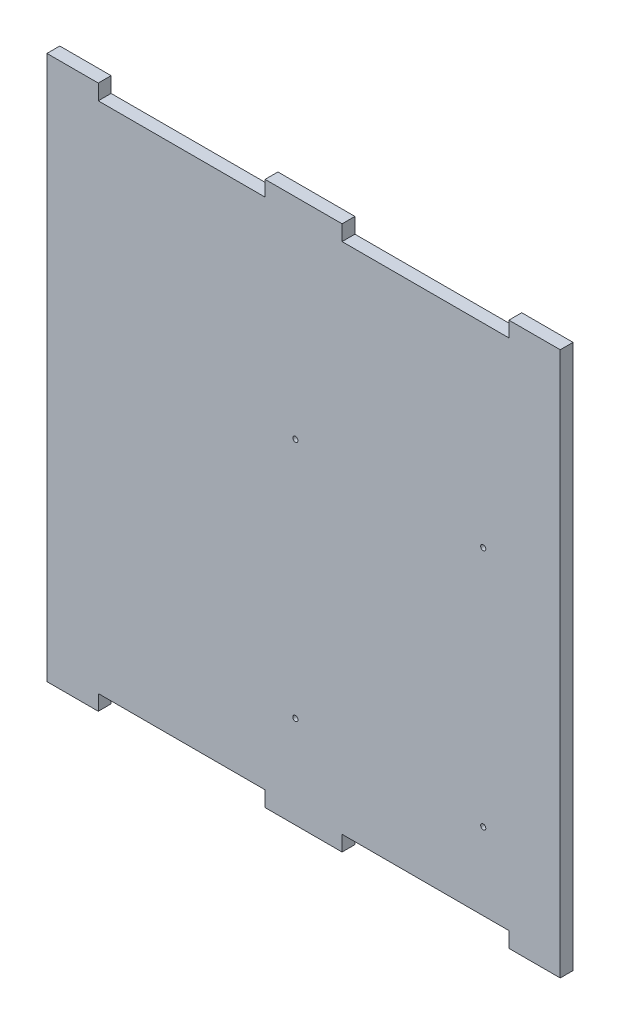
ISO-10303-21;
HEADER;
FILE_DESCRIPTION(('STEP AP214'),'2;1');
FILE_NAME('part.step','',(''),(''),'','','');
FILE_SCHEMA(('AUTOMOTIVE_DESIGN { 1 0 10303 214 1 1 1 1 }'));
ENDSEC;
DATA;
#1=APPLICATION_CONTEXT('core data for automotive mechanical design processes');
#2=APPLICATION_PROTOCOL_DEFINITION('international standard','automotive_design',2000,#1);
#3=PRODUCT_CONTEXT('',#1,'mechanical');
#4=PRODUCT('Part','Part','',(#3));
#5=PRODUCT_RELATED_PRODUCT_CATEGORY('part','',(#4));
#6=PRODUCT_DEFINITION_FORMATION('','',#4);
#7=PRODUCT_DEFINITION_CONTEXT('part definition',#1,'design');
#8=PRODUCT_DEFINITION('design','',#6,#7);
#9=PRODUCT_DEFINITION_SHAPE('','',#8);
#10=(LENGTH_UNIT() NAMED_UNIT(*) SI_UNIT(.MILLI.,.METRE.));
#11=(NAMED_UNIT(*) PLANE_ANGLE_UNIT() SI_UNIT($,.RADIAN.));
#12=(NAMED_UNIT(*) SI_UNIT($,.STERADIAN.) SOLID_ANGLE_UNIT());
#13=UNCERTAINTY_MEASURE_WITH_UNIT(LENGTH_MEASURE(1.E-05),#10,'distance_accuracy_value','');
#14=(GEOMETRIC_REPRESENTATION_CONTEXT(3) GLOBAL_UNCERTAINTY_ASSIGNED_CONTEXT((#13)) GLOBAL_UNIT_ASSIGNED_CONTEXT((#10,
#11,#12)) REPRESENTATION_CONTEXT('',''));
#15=CARTESIAN_POINT('',(0.,0.,0.));
#16=DIRECTION('',(0.,0.,1.));
#17=DIRECTION('',(1.,0.,0.));
#18=AXIS2_PLACEMENT_3D('',#15,#16,#17);
#19=CARTESIAN_POINT('',(0.,0.,5.));
#20=DIRECTION('',(0.,0.,-1.));
#21=DIRECTION('',(-1.,0.,0.));
#22=AXIS2_PLACEMENT_3D('',#19,#20,#21);
#23=PLANE('',#22);
#24=DIRECTION('',(1.,0.,0.));
#25=VECTOR('',#24,1.);
#26=CARTESIAN_POINT('',(20.,0.,5.));
#27=LINE('',#26,#25);
#28=CARTESIAN_POINT('',(0.,0.,5.));
#29=VERTEX_POINT('',#28);
#30=CARTESIAN_POINT('',(20.,0.,5.));
#31=VERTEX_POINT('',#30);
#32=EDGE_CURVE('E241',#29,#31,#27,.T.);
#33=ORIENTED_EDGE('',*,*,#32,.T.);
#34=DIRECTION('',(0.,1.,0.));
#35=VECTOR('',#34,1.);
#36=CARTESIAN_POINT('',(20.,6.,5.));
#37=LINE('',#36,#35);
#38=CARTESIAN_POINT('',(20.,6.,5.));
#39=VERTEX_POINT('',#38);
#40=EDGE_CURVE('E129',#31,#39,#37,.T.);
#41=ORIENTED_EDGE('',*,*,#40,.T.);
#42=DIRECTION('',(1.,0.,0.));
#43=VECTOR('',#42,1.);
#44=CARTESIAN_POINT('',(20.,6.,5.));
#45=LINE('',#44,#43);
#46=CARTESIAN_POINT('',(85.,6.,5.));
#47=VERTEX_POINT('',#46);
#48=EDGE_CURVE('E292',#39,#47,#45,.T.);
#49=ORIENTED_EDGE('',*,*,#48,.T.);
#50=DIRECTION('',(0.,-1.,0.));
#51=VECTOR('',#50,1.);
#52=CARTESIAN_POINT('',(85.,6.,5.));
#53=LINE('',#52,#51);
#54=CARTESIAN_POINT('',(85.,0.,5.));
#55=VERTEX_POINT('',#54);
#56=EDGE_CURVE('E311',#47,#55,#53,.T.);
#57=ORIENTED_EDGE('',*,*,#56,.T.);
#58=DIRECTION('',(1.,0.,0.));
#59=VECTOR('',#58,1.);
#60=CARTESIAN_POINT('',(85.,0.,5.));
#61=LINE('',#60,#59);
#62=CARTESIAN_POINT('',(115.,0.,5.));
#63=VERTEX_POINT('',#62);
#64=EDGE_CURVE('E308',#55,#63,#61,.T.);
#65=ORIENTED_EDGE('',*,*,#64,.T.);
#66=DIRECTION('',(0.,1.,0.));
#67=VECTOR('',#66,1.);
#68=CARTESIAN_POINT('',(115.,0.,5.));
#69=LINE('',#68,#67);
#70=CARTESIAN_POINT('',(115.,6.,5.));
#71=VERTEX_POINT('',#70);
#72=EDGE_CURVE('E310',#63,#71,#69,.T.);
#73=ORIENTED_EDGE('',*,*,#72,.T.);
#74=DIRECTION('',(1.,0.,0.));
#75=VECTOR('',#74,1.);
#76=CARTESIAN_POINT('',(115.,6.,5.));
#77=LINE('',#76,#75);
#78=CARTESIAN_POINT('',(180.,6.,5.));
#79=VERTEX_POINT('',#78);
#80=EDGE_CURVE('E313',#71,#79,#77,.T.);
#81=ORIENTED_EDGE('',*,*,#80,.T.);
#82=DIRECTION('',(0.,-1.,0.));
#83=VECTOR('',#82,1.);
#84=CARTESIAN_POINT('',(180.,0.,5.));
#85=LINE('',#84,#83);
#86=CARTESIAN_POINT('',(180.,0.,5.));
#87=VERTEX_POINT('',#86);
#88=EDGE_CURVE('E319',#79,#87,#85,.T.);
#89=ORIENTED_EDGE('',*,*,#88,.T.);
#90=DIRECTION('',(1.,0.,0.));
#91=VECTOR('',#90,1.);
#92=CARTESIAN_POINT('',(200.,0.,5.));
#93=LINE('',#92,#91);
#94=CARTESIAN_POINT('',(200.,0.,5.));
#95=VERTEX_POINT('',#94);
#96=EDGE_CURVE('E321',#87,#95,#93,.T.);
#97=ORIENTED_EDGE('',*,*,#96,.T.);
#98=DIRECTION('',(0.,1.,0.));
#99=VECTOR('',#98,1.);
#100=CARTESIAN_POINT('',(200.,212.,5.));
#101=LINE('',#100,#99);
#102=CARTESIAN_POINT('',(200.,212.,5.));
#103=VERTEX_POINT('',#102);
#104=EDGE_CURVE('E323',#95,#103,#101,.T.);
#105=ORIENTED_EDGE('',*,*,#104,.T.);
#106=DIRECTION('',(-1.,0.,0.));
#107=VECTOR('',#106,1.);
#108=CARTESIAN_POINT('',(180.,212.,5.));
#109=LINE('',#108,#107);
#110=CARTESIAN_POINT('',(180.,212.,5.));
#111=VERTEX_POINT('',#110);
#112=EDGE_CURVE('E325',#103,#111,#109,.T.);
#113=ORIENTED_EDGE('',*,*,#112,.T.);
#114=DIRECTION('',(0.,-1.,0.));
#115=VECTOR('',#114,1.);
#116=CARTESIAN_POINT('',(180.,206.,5.));
#117=LINE('',#116,#115);
#118=CARTESIAN_POINT('',(180.,206.,5.));
#119=VERTEX_POINT('',#118);
#120=EDGE_CURVE('E327',#111,#119,#117,.T.);
#121=ORIENTED_EDGE('',*,*,#120,.T.);
#122=DIRECTION('',(-1.,0.,0.));
#123=VECTOR('',#122,1.);
#124=CARTESIAN_POINT('',(115.,206.,5.));
#125=LINE('',#124,#123);
#126=CARTESIAN_POINT('',(115.,206.,5.));
#127=VERTEX_POINT('',#126);
#128=EDGE_CURVE('E329',#119,#127,#125,.T.);
#129=ORIENTED_EDGE('',*,*,#128,.T.);
#130=DIRECTION('',(0.,1.,0.));
#131=VECTOR('',#130,1.);
#132=CARTESIAN_POINT('',(115.,212.,5.));
#133=LINE('',#132,#131);
#134=CARTESIAN_POINT('',(115.,212.,5.));
#135=VERTEX_POINT('',#134);
#136=EDGE_CURVE('E331',#127,#135,#133,.T.);
#137=ORIENTED_EDGE('',*,*,#136,.T.);
#138=DIRECTION('',(-1.,0.,0.));
#139=VECTOR('',#138,1.);
#140=CARTESIAN_POINT('',(85.,212.,5.));
#141=LINE('',#140,#139);
#142=CARTESIAN_POINT('',(85.,212.,5.));
#143=VERTEX_POINT('',#142);
#144=EDGE_CURVE('E333',#135,#143,#141,.T.);
#145=ORIENTED_EDGE('',*,*,#144,.T.);
#146=DIRECTION('',(0.,-1.,0.));
#147=VECTOR('',#146,1.);
#148=CARTESIAN_POINT('',(85.,206.,5.));
#149=LINE('',#148,#147);
#150=CARTESIAN_POINT('',(85.,206.,5.));
#151=VERTEX_POINT('',#150);
#152=EDGE_CURVE('E335',#143,#151,#149,.T.);
#153=ORIENTED_EDGE('',*,*,#152,.T.);
#154=DIRECTION('',(-1.,0.,0.));
#155=VECTOR('',#154,1.);
#156=CARTESIAN_POINT('',(20.,206.,5.));
#157=LINE('',#156,#155);
#158=CARTESIAN_POINT('',(20.,206.,5.));
#159=VERTEX_POINT('',#158);
#160=EDGE_CURVE('E184',#151,#159,#157,.T.);
#161=ORIENTED_EDGE('',*,*,#160,.T.);
#162=DIRECTION('',(0.,1.,0.));
#163=VECTOR('',#162,1.);
#164=CARTESIAN_POINT('',(20.,212.,5.));
#165=LINE('',#164,#163);
#166=CARTESIAN_POINT('',(20.,212.,5.));
#167=VERTEX_POINT('',#166);
#168=EDGE_CURVE('E178',#159,#167,#165,.T.);
#169=ORIENTED_EDGE('',*,*,#168,.T.);
#170=DIRECTION('',(-1.,0.,0.));
#171=VECTOR('',#170,1.);
#172=CARTESIAN_POINT('',(0.,212.,5.));
#173=LINE('',#172,#171);
#174=CARTESIAN_POINT('',(0.,212.,5.));
#175=VERTEX_POINT('',#174);
#176=EDGE_CURVE('E182',#167,#175,#173,.T.);
#177=ORIENTED_EDGE('',*,*,#176,.T.);
#178=DIRECTION('',(0.,-1.,0.));
#179=VECTOR('',#178,1.);
#180=CARTESIAN_POINT('',(0.,0.,5.));
#181=LINE('',#180,#179);
#182=EDGE_CURVE('E50',#175,#29,#181,.T.);
#183=ORIENTED_EDGE('',*,*,#182,.T.);
#184=EDGE_LOOP('',(#33,#41,#49,#57,#65,#73,#81,#89,#97,#105,#113,#121,#129,#137,#145,#153,#161,
#169,#177,#183));
#185=FACE_BOUND('',#184,.T.);
#186=CARTESIAN_POINT('',(170.,36.,5.));
#187=DIRECTION('',(0.,0.,1.));
#188=DIRECTION('',(1.,0.,0.));
#189=AXIS2_PLACEMENT_3D('',#186,#187,#188);
#190=CIRCLE('',#189,0.999999999999998);
#191=CARTESIAN_POINT('',(171.,36.,5.));
#192=VERTEX_POINT('',#191);
#193=EDGE_CURVE('E206',#192,#192,#190,.T.);
#194=ORIENTED_EDGE('',*,*,#193,.F.);
#195=EDGE_LOOP('',(#194));
#196=FACE_BOUND('',#195,.T.);
#197=CARTESIAN_POINT('',(96.8,35.9999999999993,5.));
#198=DIRECTION('',(0.,0.,1.));
#199=DIRECTION('',(1.,0.,0.));
#200=AXIS2_PLACEMENT_3D('',#197,#198,#199);
#201=CIRCLE('',#200,0.999999999999998);
#202=CARTESIAN_POINT('',(97.8,35.9999999999993,5.));
#203=VERTEX_POINT('',#202);
#204=EDGE_CURVE('E399',#203,#203,#201,.T.);
#205=ORIENTED_EDGE('',*,*,#204,.F.);
#206=EDGE_LOOP('',(#205));
#207=FACE_BOUND('',#206,.T.);
#208=CARTESIAN_POINT('',(96.7999999999997,130.199999999999,5.));
#209=DIRECTION('',(0.,0.,1.));
#210=DIRECTION('',(1.,0.,0.));
#211=AXIS2_PLACEMENT_3D('',#208,#209,#210);
#212=CIRCLE('',#211,0.999999999999998);
#213=CARTESIAN_POINT('',(97.7999999999997,130.199999999999,5.));
#214=VERTEX_POINT('',#213);
#215=EDGE_CURVE('E393',#214,#214,#212,.T.);
#216=ORIENTED_EDGE('',*,*,#215,.F.);
#217=EDGE_LOOP('',(#216));
#218=FACE_BOUND('',#217,.T.);
#219=CARTESIAN_POINT('',(170.,130.2,5.));
#220=DIRECTION('',(0.,0.,1.));
#221=DIRECTION('',(1.,0.,0.));
#222=AXIS2_PLACEMENT_3D('',#219,#220,#221);
#223=CIRCLE('',#222,0.999999999999998);
#224=CARTESIAN_POINT('',(171.,130.2,5.));
#225=VERTEX_POINT('',#224);
#226=EDGE_CURVE('E384',#225,#225,#223,.T.);
#227=ORIENTED_EDGE('',*,*,#226,.F.);
#228=EDGE_LOOP('',(#227));
#229=FACE_BOUND('',#228,.T.);
#230=ADVANCED_FACE('F33',(#185,#196,#207,#218,#229),#23,.F.);
#231=CARTESIAN_POINT('',(0.,0.,0.));
#232=DIRECTION('',(0.,0.,-1.));
#233=DIRECTION('',(-1.,0.,0.));
#234=AXIS2_PLACEMENT_3D('',#231,#232,#233);
#235=PLANE('',#234);
#236=CARTESIAN_POINT('',(96.7999999999997,130.199999999999,0.));
#237=DIRECTION('',(0.,0.,1.));
#238=DIRECTION('',(1.,0.,0.));
#239=AXIS2_PLACEMENT_3D('',#236,#237,#238);
#240=CIRCLE('',#239,0.999999999999998);
#241=CARTESIAN_POINT('',(97.7999999999997,130.199999999999,0.));
#242=VERTEX_POINT('',#241);
#243=EDGE_CURVE('E390',#242,#242,#240,.T.);
#244=ORIENTED_EDGE('',*,*,#243,.T.);
#245=EDGE_LOOP('',(#244));
#246=FACE_BOUND('',#245,.T.);
#247=CARTESIAN_POINT('',(170.,36.,0.));
#248=DIRECTION('',(0.,0.,1.));
#249=DIRECTION('',(1.,0.,0.));
#250=AXIS2_PLACEMENT_3D('',#247,#248,#249);
#251=CIRCLE('',#250,0.999999999999998);
#252=CARTESIAN_POINT('',(171.,36.,0.));
#253=VERTEX_POINT('',#252);
#254=EDGE_CURVE('E402',#253,#253,#251,.T.);
#255=ORIENTED_EDGE('',*,*,#254,.T.);
#256=EDGE_LOOP('',(#255));
#257=FACE_BOUND('',#256,.T.);
#258=DIRECTION('',(1.,0.,0.));
#259=VECTOR('',#258,1.);
#260=CARTESIAN_POINT('',(20.,0.,0.));
#261=LINE('',#260,#259);
#262=CARTESIAN_POINT('',(0.,0.,0.));
#263=VERTEX_POINT('',#262);
#264=CARTESIAN_POINT('',(20.,0.,0.));
#265=VERTEX_POINT('',#264);
#266=EDGE_CURVE('E202',#263,#265,#261,.T.);
#267=ORIENTED_EDGE('',*,*,#266,.F.);
#268=DIRECTION('',(0.,-1.,0.));
#269=VECTOR('',#268,1.);
#270=CARTESIAN_POINT('',(0.,0.,0.));
#271=LINE('',#270,#269);
#272=CARTESIAN_POINT('',(0.,212.,0.));
#273=VERTEX_POINT('',#272);
#274=EDGE_CURVE('E121',#273,#263,#271,.T.);
#275=ORIENTED_EDGE('',*,*,#274,.F.);
#276=DIRECTION('',(-1.,0.,0.));
#277=VECTOR('',#276,1.);
#278=CARTESIAN_POINT('',(0.,212.,0.));
#279=LINE('',#278,#277);
#280=CARTESIAN_POINT('',(20.,212.,0.));
#281=VERTEX_POINT('',#280);
#282=EDGE_CURVE('E115',#281,#273,#279,.T.);
#283=ORIENTED_EDGE('',*,*,#282,.F.);
#284=DIRECTION('',(0.,1.,0.));
#285=VECTOR('',#284,1.);
#286=CARTESIAN_POINT('',(20.,212.,0.));
#287=LINE('',#286,#285);
#288=CARTESIAN_POINT('',(20.,206.,0.));
#289=VERTEX_POINT('',#288);
#290=EDGE_CURVE('E192',#289,#281,#287,.T.);
#291=ORIENTED_EDGE('',*,*,#290,.F.);
#292=DIRECTION('',(-1.,0.,0.));
#293=VECTOR('',#292,1.);
#294=CARTESIAN_POINT('',(20.,206.,0.));
#295=LINE('',#294,#293);
#296=CARTESIAN_POINT('',(85.,206.,0.));
#297=VERTEX_POINT('',#296);
#298=EDGE_CURVE('E236',#297,#289,#295,.T.);
#299=ORIENTED_EDGE('',*,*,#298,.F.);
#300=DIRECTION('',(0.,-1.,0.));
#301=VECTOR('',#300,1.);
#302=CARTESIAN_POINT('',(85.,206.,0.));
#303=LINE('',#302,#301);
#304=CARTESIAN_POINT('',(85.,212.,0.));
#305=VERTEX_POINT('',#304);
#306=EDGE_CURVE('E234',#305,#297,#303,.T.);
#307=ORIENTED_EDGE('',*,*,#306,.F.);
#308=DIRECTION('',(-1.,0.,0.));
#309=VECTOR('',#308,1.);
#310=CARTESIAN_POINT('',(85.,212.,0.));
#311=LINE('',#310,#309);
#312=CARTESIAN_POINT('',(115.,212.,0.));
#313=VERTEX_POINT('',#312);
#314=EDGE_CURVE('E232',#313,#305,#311,.T.);
#315=ORIENTED_EDGE('',*,*,#314,.F.);
#316=DIRECTION('',(0.,1.,0.));
#317=VECTOR('',#316,1.);
#318=CARTESIAN_POINT('',(115.,212.,0.));
#319=LINE('',#318,#317);
#320=CARTESIAN_POINT('',(115.,206.,0.));
#321=VERTEX_POINT('',#320);
#322=EDGE_CURVE('E230',#321,#313,#319,.T.);
#323=ORIENTED_EDGE('',*,*,#322,.F.);
#324=DIRECTION('',(-1.,0.,0.));
#325=VECTOR('',#324,1.);
#326=CARTESIAN_POINT('',(115.,206.,0.));
#327=LINE('',#326,#325);
#328=CARTESIAN_POINT('',(180.,206.,0.));
#329=VERTEX_POINT('',#328);
#330=EDGE_CURVE('E228',#329,#321,#327,.T.);
#331=ORIENTED_EDGE('',*,*,#330,.F.);
#332=DIRECTION('',(0.,-1.,0.));
#333=VECTOR('',#332,1.);
#334=CARTESIAN_POINT('',(180.,206.,0.));
#335=LINE('',#334,#333);
#336=CARTESIAN_POINT('',(180.,212.,0.));
#337=VERTEX_POINT('',#336);
#338=EDGE_CURVE('E226',#337,#329,#335,.T.);
#339=ORIENTED_EDGE('',*,*,#338,.F.);
#340=DIRECTION('',(-1.,0.,0.));
#341=VECTOR('',#340,1.);
#342=CARTESIAN_POINT('',(180.,212.,0.));
#343=LINE('',#342,#341);
#344=CARTESIAN_POINT('',(200.,212.,0.));
#345=VERTEX_POINT('',#344);
#346=EDGE_CURVE('E224',#345,#337,#343,.T.);
#347=ORIENTED_EDGE('',*,*,#346,.F.);
#348=DIRECTION('',(0.,1.,0.));
#349=VECTOR('',#348,1.);
#350=CARTESIAN_POINT('',(200.,212.,0.));
#351=LINE('',#350,#349);
#352=CARTESIAN_POINT('',(200.,0.,0.));
#353=VERTEX_POINT('',#352);
#354=EDGE_CURVE('E222',#353,#345,#351,.T.);
#355=ORIENTED_EDGE('',*,*,#354,.F.);
#356=DIRECTION('',(1.,0.,0.));
#357=VECTOR('',#356,1.);
#358=CARTESIAN_POINT('',(200.,0.,0.));
#359=LINE('',#358,#357);
#360=CARTESIAN_POINT('',(180.,0.,0.));
#361=VERTEX_POINT('',#360);
#362=EDGE_CURVE('E220',#361,#353,#359,.T.);
#363=ORIENTED_EDGE('',*,*,#362,.F.);
#364=DIRECTION('',(0.,-1.,0.));
#365=VECTOR('',#364,1.);
#366=CARTESIAN_POINT('',(180.,0.,0.));
#367=LINE('',#366,#365);
#368=CARTESIAN_POINT('',(180.,6.,0.));
#369=VERTEX_POINT('',#368);
#370=EDGE_CURVE('E218',#369,#361,#367,.T.);
#371=ORIENTED_EDGE('',*,*,#370,.F.);
#372=DIRECTION('',(1.,0.,0.));
#373=VECTOR('',#372,1.);
#374=CARTESIAN_POINT('',(115.,6.,0.));
#375=LINE('',#374,#373);
#376=CARTESIAN_POINT('',(115.,6.,0.));
#377=VERTEX_POINT('',#376);
#378=EDGE_CURVE('E216',#377,#369,#375,.T.);
#379=ORIENTED_EDGE('',*,*,#378,.F.);
#380=DIRECTION('',(0.,1.,0.));
#381=VECTOR('',#380,1.);
#382=CARTESIAN_POINT('',(115.,0.,0.));
#383=LINE('',#382,#381);
#384=CARTESIAN_POINT('',(115.,0.,0.));
#385=VERTEX_POINT('',#384);
#386=EDGE_CURVE('E214',#385,#377,#383,.T.);
#387=ORIENTED_EDGE('',*,*,#386,.F.);
#388=DIRECTION('',(1.,0.,0.));
#389=VECTOR('',#388,1.);
#390=CARTESIAN_POINT('',(85.,0.,0.));
#391=LINE('',#390,#389);
#392=CARTESIAN_POINT('',(85.,0.,0.));
#393=VERTEX_POINT('',#392);
#394=EDGE_CURVE('E212',#393,#385,#391,.T.);
#395=ORIENTED_EDGE('',*,*,#394,.F.);
#396=DIRECTION('',(0.,-1.,0.));
#397=VECTOR('',#396,1.);
#398=CARTESIAN_POINT('',(85.,6.,0.));
#399=LINE('',#398,#397);
#400=CARTESIAN_POINT('',(85.,6.,0.));
#401=VERTEX_POINT('',#400);
#402=EDGE_CURVE('E210',#401,#393,#399,.T.);
#403=ORIENTED_EDGE('',*,*,#402,.F.);
#404=DIRECTION('',(1.,0.,0.));
#405=VECTOR('',#404,1.);
#406=CARTESIAN_POINT('',(20.,6.,0.));
#407=LINE('',#406,#405);
#408=CARTESIAN_POINT('',(20.,6.,0.));
#409=VERTEX_POINT('',#408);
#410=EDGE_CURVE('E208',#409,#401,#407,.T.);
#411=ORIENTED_EDGE('',*,*,#410,.F.);
#412=DIRECTION('',(0.,1.,0.));
#413=VECTOR('',#412,1.);
#414=CARTESIAN_POINT('',(20.,6.,0.));
#415=LINE('',#414,#413);
#416=EDGE_CURVE('E205',#265,#409,#415,.T.);
#417=ORIENTED_EDGE('',*,*,#416,.F.);
#418=EDGE_LOOP('',(#267,#275,#283,#291,#299,#307,#315,#323,#331,#339,#347,#355,#363,#371,#379,
#387,#395,#403,#411,#417));
#419=FACE_BOUND('',#418,.T.);
#420=CARTESIAN_POINT('',(96.8,35.9999999999993,0.));
#421=DIRECTION('',(0.,0.,1.));
#422=DIRECTION('',(1.,0.,0.));
#423=AXIS2_PLACEMENT_3D('',#420,#421,#422);
#424=CIRCLE('',#423,0.999999999999998);
#425=CARTESIAN_POINT('',(97.8,35.9999999999993,0.));
#426=VERTEX_POINT('',#425);
#427=EDGE_CURVE('E396',#426,#426,#424,.T.);
#428=ORIENTED_EDGE('',*,*,#427,.T.);
#429=EDGE_LOOP('',(#428));
#430=FACE_BOUND('',#429,.T.);
#431=CARTESIAN_POINT('',(170.,130.2,0.));
#432=DIRECTION('',(0.,0.,1.));
#433=DIRECTION('',(1.,0.,0.));
#434=AXIS2_PLACEMENT_3D('',#431,#432,#433);
#435=CIRCLE('',#434,0.999999999999998);
#436=CARTESIAN_POINT('',(171.,130.2,0.));
#437=VERTEX_POINT('',#436);
#438=EDGE_CURVE('E387',#437,#437,#435,.T.);
#439=ORIENTED_EDGE('',*,*,#438,.T.);
#440=EDGE_LOOP('',(#439));
#441=FACE_BOUND('',#440,.T.);
#442=ADVANCED_FACE('F296',(#246,#257,#419,#430,#441),#235,.T.);
#443=CARTESIAN_POINT('',(20.,0.,5.));
#444=DIRECTION('',(0.,1.,0.));
#445=DIRECTION('',(-1.,0.,0.));
#446=AXIS2_PLACEMENT_3D('',#443,#444,#445);
#447=PLANE('',#446);
#448=ORIENTED_EDGE('',*,*,#266,.T.);
#449=DIRECTION('',(0.,0.,-1.));
#450=VECTOR('',#449,1.);
#451=CARTESIAN_POINT('',(20.,0.,5.));
#452=LINE('',#451,#450);
#453=EDGE_CURVE('E11',#31,#265,#452,.T.);
#454=ORIENTED_EDGE('',*,*,#453,.F.);
#455=ORIENTED_EDGE('',*,*,#32,.F.);
#456=DIRECTION('',(0.,0.,-1.));
#457=VECTOR('',#456,1.);
#458=CARTESIAN_POINT('',(0.,0.,5.));
#459=LINE('',#458,#457);
#460=EDGE_CURVE('E198',#29,#263,#459,.T.);
#461=ORIENTED_EDGE('',*,*,#460,.T.);
#462=EDGE_LOOP('',(#448,#454,#455,#461));
#463=FACE_BOUND('',#462,.T.);
#464=ADVANCED_FACE('F35',(#463),#447,.F.);
#465=CARTESIAN_POINT('',(20.,6.,5.));
#466=DIRECTION('',(-1.,0.,0.));
#467=DIRECTION('',(0.,0.,1.));
#468=AXIS2_PLACEMENT_3D('',#465,#466,#467);
#469=PLANE('',#468);
#470=ORIENTED_EDGE('',*,*,#416,.T.);
#471=DIRECTION('',(0.,0.,-1.));
#472=VECTOR('',#471,1.);
#473=CARTESIAN_POINT('',(20.,6.,5.));
#474=LINE('',#473,#472);
#475=EDGE_CURVE('E42',#39,#409,#474,.T.);
#476=ORIENTED_EDGE('',*,*,#475,.F.);
#477=ORIENTED_EDGE('',*,*,#40,.F.);
#478=ORIENTED_EDGE('',*,*,#453,.T.);
#479=EDGE_LOOP('',(#470,#476,#477,#478));
#480=FACE_BOUND('',#479,.T.);
#481=ADVANCED_FACE('F594',(#480),#469,.F.);
#482=CARTESIAN_POINT('',(20.,6.,5.));
#483=DIRECTION('',(0.,1.,0.));
#484=DIRECTION('',(0.,0.,1.));
#485=AXIS2_PLACEMENT_3D('',#482,#483,#484);
#486=PLANE('',#485);
#487=ORIENTED_EDGE('',*,*,#410,.T.);
#488=DIRECTION('',(0.,0.,-1.));
#489=VECTOR('',#488,1.);
#490=CARTESIAN_POINT('',(85.,6.,5.));
#491=LINE('',#490,#489);
#492=EDGE_CURVE('E284',#47,#401,#491,.T.);
#493=ORIENTED_EDGE('',*,*,#492,.F.);
#494=ORIENTED_EDGE('',*,*,#48,.F.);
#495=ORIENTED_EDGE('',*,*,#475,.T.);
#496=EDGE_LOOP('',(#487,#493,#494,#495));
#497=FACE_BOUND('',#496,.T.);
#498=ADVANCED_FACE('F290',(#497),#486,.F.);
#499=CARTESIAN_POINT('',(85.,6.,5.));
#500=DIRECTION('',(1.,0.,0.));
#501=DIRECTION('',(0.,0.,-1.));
#502=AXIS2_PLACEMENT_3D('',#499,#500,#501);
#503=PLANE('',#502);
#504=ORIENTED_EDGE('',*,*,#402,.T.);
#505=DIRECTION('',(0.,0.,-1.));
#506=VECTOR('',#505,1.);
#507=CARTESIAN_POINT('',(85.,0.,5.));
#508=LINE('',#507,#506);
#509=EDGE_CURVE('E281',#55,#393,#508,.T.);
#510=ORIENTED_EDGE('',*,*,#509,.F.);
#511=ORIENTED_EDGE('',*,*,#56,.F.);
#512=ORIENTED_EDGE('',*,*,#492,.T.);
#513=EDGE_LOOP('',(#504,#510,#511,#512));
#514=FACE_BOUND('',#513,.T.);
#515=ADVANCED_FACE('F302',(#514),#503,.F.);
#516=CARTESIAN_POINT('',(85.,0.,5.));
#517=DIRECTION('',(0.,1.,0.));
#518=DIRECTION('',(0.,0.,1.));
#519=AXIS2_PLACEMENT_3D('',#516,#517,#518);
#520=PLANE('',#519);
#521=ORIENTED_EDGE('',*,*,#394,.T.);
#522=DIRECTION('',(0.,0.,-1.));
#523=VECTOR('',#522,1.);
#524=CARTESIAN_POINT('',(115.,0.,5.));
#525=LINE('',#524,#523);
#526=EDGE_CURVE('E278',#63,#385,#525,.T.);
#527=ORIENTED_EDGE('',*,*,#526,.F.);
#528=ORIENTED_EDGE('',*,*,#64,.F.);
#529=ORIENTED_EDGE('',*,*,#509,.T.);
#530=EDGE_LOOP('',(#521,#527,#528,#529));
#531=FACE_BOUND('',#530,.T.);
#532=ADVANCED_FACE('F306',(#531),#520,.F.);
#533=CARTESIAN_POINT('',(115.,0.,5.));
#534=DIRECTION('',(-1.,0.,0.));
#535=DIRECTION('',(0.,0.,1.));
#536=AXIS2_PLACEMENT_3D('',#533,#534,#535);
#537=PLANE('',#536);
#538=ORIENTED_EDGE('',*,*,#386,.T.);
#539=DIRECTION('',(0.,0.,-1.));
#540=VECTOR('',#539,1.);
#541=CARTESIAN_POINT('',(115.,6.,5.));
#542=LINE('',#541,#540);
#543=EDGE_CURVE('E275',#71,#377,#542,.T.);
#544=ORIENTED_EDGE('',*,*,#543,.F.);
#545=ORIENTED_EDGE('',*,*,#72,.F.);
#546=ORIENTED_EDGE('',*,*,#526,.T.);
#547=EDGE_LOOP('',(#538,#544,#545,#546));
#548=FACE_BOUND('',#547,.T.);
#549=ADVANCED_FACE('F559',(#548),#537,.F.);
#550=CARTESIAN_POINT('',(115.,6.,5.));
#551=DIRECTION('',(0.,1.,0.));
#552=DIRECTION('',(0.,0.,1.));
#553=AXIS2_PLACEMENT_3D('',#550,#551,#552);
#554=PLANE('',#553);
#555=ORIENTED_EDGE('',*,*,#378,.T.);
#556=DIRECTION('',(0.,0.,-1.));
#557=VECTOR('',#556,1.);
#558=CARTESIAN_POINT('',(180.,6.,5.));
#559=LINE('',#558,#557);
#560=EDGE_CURVE('E272',#79,#369,#559,.T.);
#561=ORIENTED_EDGE('',*,*,#560,.F.);
#562=ORIENTED_EDGE('',*,*,#80,.F.);
#563=ORIENTED_EDGE('',*,*,#543,.T.);
#564=EDGE_LOOP('',(#555,#561,#562,#563));
#565=FACE_BOUND('',#564,.T.);
#566=ADVANCED_FACE('F549',(#565),#554,.F.);
#567=CARTESIAN_POINT('',(180.,0.,5.));
#568=DIRECTION('',(1.,0.,0.));
#569=DIRECTION('',(0.,0.,-1.));
#570=AXIS2_PLACEMENT_3D('',#567,#568,#569);
#571=PLANE('',#570);
#572=ORIENTED_EDGE('',*,*,#370,.T.);
#573=DIRECTION('',(0.,0.,-1.));
#574=VECTOR('',#573,1.);
#575=CARTESIAN_POINT('',(180.,0.,5.));
#576=LINE('',#575,#574);
#577=EDGE_CURVE('E269',#87,#361,#576,.T.);
#578=ORIENTED_EDGE('',*,*,#577,.F.);
#579=ORIENTED_EDGE('',*,*,#88,.F.);
#580=ORIENTED_EDGE('',*,*,#560,.T.);
#581=EDGE_LOOP('',(#572,#578,#579,#580));
#582=FACE_BOUND('',#581,.T.);
#583=ADVANCED_FACE('F539',(#582),#571,.F.);
#584=CARTESIAN_POINT('',(200.,0.,5.));
#585=DIRECTION('',(0.,1.,0.));
#586=DIRECTION('',(-1.,0.,0.));
#587=AXIS2_PLACEMENT_3D('',#584,#585,#586);
#588=PLANE('',#587);
#589=ORIENTED_EDGE('',*,*,#362,.T.);
#590=DIRECTION('',(0.,0.,-1.));
#591=VECTOR('',#590,1.);
#592=CARTESIAN_POINT('',(200.,0.,5.));
#593=LINE('',#592,#591);
#594=EDGE_CURVE('E266',#95,#353,#593,.T.);
#595=ORIENTED_EDGE('',*,*,#594,.F.);
#596=ORIENTED_EDGE('',*,*,#96,.F.);
#597=ORIENTED_EDGE('',*,*,#577,.T.);
#598=EDGE_LOOP('',(#589,#595,#596,#597));
#599=FACE_BOUND('',#598,.T.);
#600=ADVANCED_FACE('F529',(#599),#588,.F.);
#601=CARTESIAN_POINT('',(200.,212.,5.));
#602=DIRECTION('',(-1.,0.,0.));
#603=DIRECTION('',(0.,-1.,0.));
#604=AXIS2_PLACEMENT_3D('',#601,#602,#603);
#605=PLANE('',#604);
#606=ORIENTED_EDGE('',*,*,#354,.T.);
#607=DIRECTION('',(0.,0.,-1.));
#608=VECTOR('',#607,1.);
#609=CARTESIAN_POINT('',(200.,212.,5.));
#610=LINE('',#609,#608);
#611=EDGE_CURVE('E263',#103,#345,#610,.T.);
#612=ORIENTED_EDGE('',*,*,#611,.F.);
#613=ORIENTED_EDGE('',*,*,#104,.F.);
#614=ORIENTED_EDGE('',*,*,#594,.T.);
#615=EDGE_LOOP('',(#606,#612,#613,#614));
#616=FACE_BOUND('',#615,.T.);
#617=ADVANCED_FACE('F519',(#616),#605,.F.);
#618=CARTESIAN_POINT('',(180.,212.,5.));
#619=DIRECTION('',(0.,-1.,0.));
#620=DIRECTION('',(0.,0.,-1.));
#621=AXIS2_PLACEMENT_3D('',#618,#619,#620);
#622=PLANE('',#621);
#623=ORIENTED_EDGE('',*,*,#346,.T.);
#624=DIRECTION('',(0.,0.,-1.));
#625=VECTOR('',#624,1.);
#626=CARTESIAN_POINT('',(180.,212.,5.));
#627=LINE('',#626,#625);
#628=EDGE_CURVE('E260',#111,#337,#627,.T.);
#629=ORIENTED_EDGE('',*,*,#628,.F.);
#630=ORIENTED_EDGE('',*,*,#112,.F.);
#631=ORIENTED_EDGE('',*,*,#611,.T.);
#632=EDGE_LOOP('',(#623,#629,#630,#631));
#633=FACE_BOUND('',#632,.T.);
#634=ADVANCED_FACE('F509',(#633),#622,.F.);
#635=CARTESIAN_POINT('',(180.,206.,5.));
#636=DIRECTION('',(1.,0.,0.));
#637=DIRECTION('',(0.,0.,-1.));
#638=AXIS2_PLACEMENT_3D('',#635,#636,#637);
#639=PLANE('',#638);
#640=ORIENTED_EDGE('',*,*,#338,.T.);
#641=DIRECTION('',(0.,0.,-1.));
#642=VECTOR('',#641,1.);
#643=CARTESIAN_POINT('',(180.,206.,5.));
#644=LINE('',#643,#642);
#645=EDGE_CURVE('E257',#119,#329,#644,.T.);
#646=ORIENTED_EDGE('',*,*,#645,.F.);
#647=ORIENTED_EDGE('',*,*,#120,.F.);
#648=ORIENTED_EDGE('',*,*,#628,.T.);
#649=EDGE_LOOP('',(#640,#646,#647,#648));
#650=FACE_BOUND('',#649,.T.);
#651=ADVANCED_FACE('F499',(#650),#639,.F.);
#652=CARTESIAN_POINT('',(115.,206.,5.));
#653=DIRECTION('',(0.,-1.,0.));
#654=DIRECTION('',(0.,0.,-1.));
#655=AXIS2_PLACEMENT_3D('',#652,#653,#654);
#656=PLANE('',#655);
#657=ORIENTED_EDGE('',*,*,#330,.T.);
#658=DIRECTION('',(0.,0.,-1.));
#659=VECTOR('',#658,1.);
#660=CARTESIAN_POINT('',(115.,206.,5.));
#661=LINE('',#660,#659);
#662=EDGE_CURVE('E254',#127,#321,#661,.T.);
#663=ORIENTED_EDGE('',*,*,#662,.F.);
#664=ORIENTED_EDGE('',*,*,#128,.F.);
#665=ORIENTED_EDGE('',*,*,#645,.T.);
#666=EDGE_LOOP('',(#657,#663,#664,#665));
#667=FACE_BOUND('',#666,.T.);
#668=ADVANCED_FACE('F489',(#667),#656,.F.);
#669=CARTESIAN_POINT('',(115.,212.,5.));
#670=DIRECTION('',(-1.,0.,0.));
#671=DIRECTION('',(0.,0.,1.));
#672=AXIS2_PLACEMENT_3D('',#669,#670,#671);
#673=PLANE('',#672);
#674=ORIENTED_EDGE('',*,*,#322,.T.);
#675=DIRECTION('',(0.,0.,-1.));
#676=VECTOR('',#675,1.);
#677=CARTESIAN_POINT('',(115.,212.,5.));
#678=LINE('',#677,#676);
#679=EDGE_CURVE('E251',#135,#313,#678,.T.);
#680=ORIENTED_EDGE('',*,*,#679,.F.);
#681=ORIENTED_EDGE('',*,*,#136,.F.);
#682=ORIENTED_EDGE('',*,*,#662,.T.);
#683=EDGE_LOOP('',(#674,#680,#681,#682));
#684=FACE_BOUND('',#683,.T.);
#685=ADVANCED_FACE('F479',(#684),#673,.F.);
#686=CARTESIAN_POINT('',(85.,212.,5.));
#687=DIRECTION('',(0.,-1.,0.));
#688=DIRECTION('',(0.,0.,-1.));
#689=AXIS2_PLACEMENT_3D('',#686,#687,#688);
#690=PLANE('',#689);
#691=ORIENTED_EDGE('',*,*,#314,.T.);
#692=DIRECTION('',(0.,0.,-1.));
#693=VECTOR('',#692,1.);
#694=CARTESIAN_POINT('',(85.,212.,5.));
#695=LINE('',#694,#693);
#696=EDGE_CURVE('E248',#143,#305,#695,.T.);
#697=ORIENTED_EDGE('',*,*,#696,.F.);
#698=ORIENTED_EDGE('',*,*,#144,.F.);
#699=ORIENTED_EDGE('',*,*,#679,.T.);
#700=EDGE_LOOP('',(#691,#697,#698,#699));
#701=FACE_BOUND('',#700,.T.);
#702=ADVANCED_FACE('F470',(#701),#690,.F.);
#703=CARTESIAN_POINT('',(85.,206.,5.));
#704=DIRECTION('',(1.,0.,0.));
#705=DIRECTION('',(0.,0.,-1.));
#706=AXIS2_PLACEMENT_3D('',#703,#704,#705);
#707=PLANE('',#706);
#708=ORIENTED_EDGE('',*,*,#306,.T.);
#709=DIRECTION('',(0.,0.,-1.));
#710=VECTOR('',#709,1.);
#711=CARTESIAN_POINT('',(85.,206.,5.));
#712=LINE('',#711,#710);
#713=EDGE_CURVE('E245',#151,#297,#712,.T.);
#714=ORIENTED_EDGE('',*,*,#713,.F.);
#715=ORIENTED_EDGE('',*,*,#152,.F.);
#716=ORIENTED_EDGE('',*,*,#696,.T.);
#717=EDGE_LOOP('',(#708,#714,#715,#716));
#718=FACE_BOUND('',#717,.T.);
#719=ADVANCED_FACE('F341',(#718),#707,.F.);
#720=CARTESIAN_POINT('',(20.,206.,5.));
#721=DIRECTION('',(0.,-1.,0.));
#722=DIRECTION('',(0.,0.,-1.));
#723=AXIS2_PLACEMENT_3D('',#720,#721,#722);
#724=PLANE('',#723);
#725=ORIENTED_EDGE('',*,*,#298,.T.);
#726=DIRECTION('',(0.,0.,-1.));
#727=VECTOR('',#726,1.);
#728=CARTESIAN_POINT('',(20.,206.,5.));
#729=LINE('',#728,#727);
#730=EDGE_CURVE('E193',#159,#289,#729,.T.);
#731=ORIENTED_EDGE('',*,*,#730,.F.);
#732=ORIENTED_EDGE('',*,*,#160,.F.);
#733=ORIENTED_EDGE('',*,*,#713,.T.);
#734=EDGE_LOOP('',(#725,#731,#732,#733));
#735=FACE_BOUND('',#734,.T.);
#736=ADVANCED_FACE('F345',(#735),#724,.F.);
#737=CARTESIAN_POINT('',(20.,212.,5.));
#738=DIRECTION('',(-1.,0.,0.));
#739=DIRECTION('',(0.,-1.,0.));
#740=AXIS2_PLACEMENT_3D('',#737,#738,#739);
#741=PLANE('',#740);
#742=ORIENTED_EDGE('',*,*,#290,.T.);
#743=DIRECTION('',(0.,0.,-1.));
#744=VECTOR('',#743,1.);
#745=CARTESIAN_POINT('',(20.,212.,5.));
#746=LINE('',#745,#744);
#747=EDGE_CURVE('E189',#167,#281,#746,.T.);
#748=ORIENTED_EDGE('',*,*,#747,.F.);
#749=ORIENTED_EDGE('',*,*,#168,.F.);
#750=ORIENTED_EDGE('',*,*,#730,.T.);
#751=EDGE_LOOP('',(#742,#748,#749,#750));
#752=FACE_BOUND('',#751,.T.);
#753=ADVANCED_FACE('F190',(#752),#741,.F.);
#754=CARTESIAN_POINT('',(0.,212.,5.));
#755=DIRECTION('',(0.,-1.,0.));
#756=DIRECTION('',(0.,0.,-1.));
#757=AXIS2_PLACEMENT_3D('',#754,#755,#756);
#758=PLANE('',#757);
#759=ORIENTED_EDGE('',*,*,#282,.T.);
#760=DIRECTION('',(0.,0.,-1.));
#761=VECTOR('',#760,1.);
#762=CARTESIAN_POINT('',(0.,212.,5.));
#763=LINE('',#762,#761);
#764=EDGE_CURVE('E194',#175,#273,#763,.T.);
#765=ORIENTED_EDGE('',*,*,#764,.F.);
#766=ORIENTED_EDGE('',*,*,#176,.F.);
#767=ORIENTED_EDGE('',*,*,#747,.T.);
#768=EDGE_LOOP('',(#759,#765,#766,#767));
#769=FACE_BOUND('',#768,.T.);
#770=ADVANCED_FACE('F196',(#769),#758,.F.);
#771=CARTESIAN_POINT('',(0.,0.,5.));
#772=DIRECTION('',(1.,0.,0.));
#773=DIRECTION('',(0.,0.,-1.));
#774=AXIS2_PLACEMENT_3D('',#771,#772,#773);
#775=PLANE('',#774);
#776=ORIENTED_EDGE('',*,*,#274,.T.);
#777=ORIENTED_EDGE('',*,*,#460,.F.);
#778=ORIENTED_EDGE('',*,*,#182,.F.);
#779=ORIENTED_EDGE('',*,*,#764,.T.);
#780=EDGE_LOOP('',(#776,#777,#778,#779));
#781=FACE_BOUND('',#780,.T.);
#782=ADVANCED_FACE('F349',(#781),#775,.F.);
#783=CARTESIAN_POINT('',(170.,36.,5.));
#784=DIRECTION('',(0.,0.,-1.));
#785=DIRECTION('',(-1.,0.,0.));
#786=AXIS2_PLACEMENT_3D('',#783,#784,#785);
#787=CYLINDRICAL_SURFACE('',#786,0.999999999999998);
#788=ORIENTED_EDGE('',*,*,#193,.T.);
#789=EDGE_LOOP('',(#788));
#790=FACE_BOUND('',#789,.T.);
#791=ORIENTED_EDGE('',*,*,#254,.F.);
#792=EDGE_LOOP('',(#791));
#793=FACE_BOUND('',#792,.T.);
#794=ADVANCED_FACE('F351',(#790,#793),#787,.F.);
#795=CARTESIAN_POINT('',(96.8,35.9999999999993,5.));
#796=DIRECTION('',(0.,0.,-1.));
#797=DIRECTION('',(-1.,0.,0.));
#798=AXIS2_PLACEMENT_3D('',#795,#796,#797);
#799=CYLINDRICAL_SURFACE('',#798,0.999999999999998);
#800=ORIENTED_EDGE('',*,*,#204,.T.);
#801=EDGE_LOOP('',(#800));
#802=FACE_BOUND('',#801,.T.);
#803=ORIENTED_EDGE('',*,*,#427,.F.);
#804=EDGE_LOOP('',(#803));
#805=FACE_BOUND('',#804,.T.);
#806=ADVANCED_FACE('F357',(#802,#805),#799,.F.);
#807=CARTESIAN_POINT('',(96.7999999999997,130.199999999999,5.));
#808=DIRECTION('',(0.,0.,-1.));
#809=DIRECTION('',(-1.,0.,0.));
#810=AXIS2_PLACEMENT_3D('',#807,#808,#809);
#811=CYLINDRICAL_SURFACE('',#810,0.999999999999998);
#812=ORIENTED_EDGE('',*,*,#215,.T.);
#813=EDGE_LOOP('',(#812));
#814=FACE_BOUND('',#813,.T.);
#815=ORIENTED_EDGE('',*,*,#243,.F.);
#816=EDGE_LOOP('',(#815));
#817=FACE_BOUND('',#816,.T.);
#818=ADVANCED_FACE('F371',(#814,#817),#811,.F.);
#819=CARTESIAN_POINT('',(170.,130.2,5.));
#820=DIRECTION('',(0.,0.,-1.));
#821=DIRECTION('',(-1.,0.,0.));
#822=AXIS2_PLACEMENT_3D('',#819,#820,#821);
#823=CYLINDRICAL_SURFACE('',#822,0.999999999999998);
#824=ORIENTED_EDGE('',*,*,#226,.T.);
#825=EDGE_LOOP('',(#824));
#826=FACE_BOUND('',#825,.T.);
#827=ORIENTED_EDGE('',*,*,#438,.F.);
#828=EDGE_LOOP('',(#827));
#829=FACE_BOUND('',#828,.T.);
#830=ADVANCED_FACE('F375',(#826,#829),#823,.F.);
#831=CLOSED_SHELL('',(#230,#442,#464,#481,#498,#515,#532,#549,#566,#583,#600,#617,#634,#651,
#668,#685,#702,#719,#736,#753,#770,#782,#794,#806,#818,#830));
#832=MANIFOLD_SOLID_BREP('B2',#831);
#833=ADVANCED_BREP_SHAPE_REPRESENTATION('',(#18,#832),#14);
#834=SHAPE_DEFINITION_REPRESENTATION(#9,#833);
ENDSEC;
END-ISO-10303-21;
